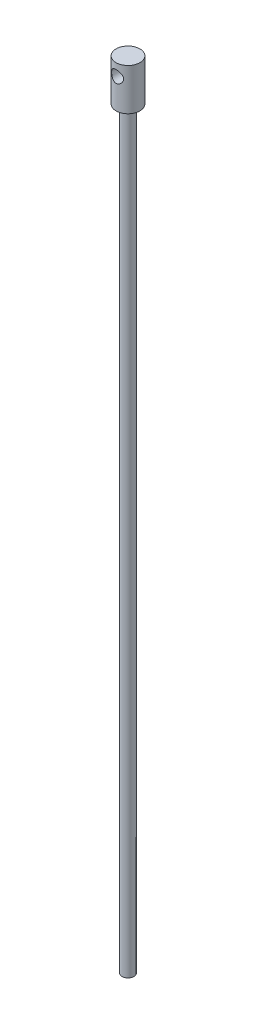
ISO-10303-21;
HEADER;
FILE_DESCRIPTION(('STEP AP214'),'2;1');
FILE_NAME('part.step','',(''),(''),'','','');
FILE_SCHEMA(('AUTOMOTIVE_DESIGN { 1 0 10303 214 1 1 1 1 }'));
ENDSEC;
DATA;
#1=APPLICATION_CONTEXT('core data for automotive mechanical design processes');
#2=APPLICATION_PROTOCOL_DEFINITION('international standard','automotive_design',2000,#1);
#3=PRODUCT_CONTEXT('',#1,'mechanical');
#4=PRODUCT('Part','Part','',(#3));
#5=PRODUCT_RELATED_PRODUCT_CATEGORY('part','',(#4));
#6=PRODUCT_DEFINITION_FORMATION('','',#4);
#7=PRODUCT_DEFINITION_CONTEXT('part definition',#1,'design');
#8=PRODUCT_DEFINITION('design','',#6,#7);
#9=PRODUCT_DEFINITION_SHAPE('','',#8);
#10=(LENGTH_UNIT() NAMED_UNIT(*) SI_UNIT(.MILLI.,.METRE.));
#11=(NAMED_UNIT(*) PLANE_ANGLE_UNIT() SI_UNIT($,.RADIAN.));
#12=(NAMED_UNIT(*) SI_UNIT($,.STERADIAN.) SOLID_ANGLE_UNIT());
#13=UNCERTAINTY_MEASURE_WITH_UNIT(LENGTH_MEASURE(1.E-05),#10,'distance_accuracy_value','');
#14=(GEOMETRIC_REPRESENTATION_CONTEXT(3) GLOBAL_UNCERTAINTY_ASSIGNED_CONTEXT((#13)) GLOBAL_UNIT_ASSIGNED_CONTEXT((#10,
#11,#12)) REPRESENTATION_CONTEXT('',''));
#15=CARTESIAN_POINT('',(0.,0.,0.));
#16=DIRECTION('',(0.,0.,1.));
#17=DIRECTION('',(1.,0.,0.));
#18=AXIS2_PLACEMENT_3D('',#15,#16,#17);
#19=CARTESIAN_POINT('',(0.,390.,0.));
#20=DIRECTION('',(0.,-1.,0.));
#21=DIRECTION('',(0.,0.,-1.));
#22=AXIS2_PLACEMENT_3D('',#19,#20,#21);
#23=CYLINDRICAL_SURFACE('',#22,3.);
#24=CARTESIAN_POINT('',(0.,0.,0.));
#25=DIRECTION('',(0.,1.,0.));
#26=DIRECTION('',(0.,0.,1.));
#27=AXIS2_PLACEMENT_3D('',#24,#25,#26);
#28=CIRCLE('',#27,3.);
#29=CARTESIAN_POINT('',(0.,0.,3.));
#30=VERTEX_POINT('',#29);
#31=EDGE_CURVE('E53',#30,#30,#28,.T.);
#32=ORIENTED_EDGE('',*,*,#31,.T.);
#33=EDGE_LOOP('',(#32));
#34=FACE_BOUND('',#33,.T.);
#35=CARTESIAN_POINT('',(0.,378.,0.));
#36=DIRECTION('',(0.,1.,0.));
#37=DIRECTION('',(0.,0.,1.));
#38=AXIS2_PLACEMENT_3D('',#35,#36,#37);
#39=CIRCLE('',#38,3.);
#40=CARTESIAN_POINT('',(0.,378.,3.));
#41=VERTEX_POINT('',#40);
#42=EDGE_CURVE('E10',#41,#41,#39,.T.);
#43=ORIENTED_EDGE('',*,*,#42,.F.);
#44=EDGE_LOOP('',(#43));
#45=FACE_BOUND('',#44,.T.);
#46=ADVANCED_FACE('F41',(#34,#45),#23,.T.);
#47=CARTESIAN_POINT('',(0.,0.,0.));
#48=DIRECTION('',(0.,1.,0.));
#49=DIRECTION('',(0.,0.,1.));
#50=AXIS2_PLACEMENT_3D('',#47,#48,#49);
#51=PLANE('',#50);
#52=ORIENTED_EDGE('',*,*,#31,.F.);
#53=EDGE_LOOP('',(#52));
#54=FACE_BOUND('',#53,.T.);
#55=ADVANCED_FACE('F84',(#54),#51,.F.);
#56=CARTESIAN_POINT('',(0.,378.,0.));
#57=DIRECTION('',(0.,1.,0.));
#58=DIRECTION('',(0.,0.,1.));
#59=AXIS2_PLACEMENT_3D('',#56,#57,#58);
#60=CYLINDRICAL_SURFACE('',#59,6.);
#61=CARTESIAN_POINT('',(0.,390.,6.));
#62=CARTESIAN_POINT('',(0.0788941476270884,390.000000838741,5.99999934964153));
#63=CARTESIAN_POINT('',(0.157796620407948,390.003117945476,5.99843869002385));
#64=CARTESIAN_POINT('',(0.315001991255919,390.01553927174,5.99224358793258));
#65=CARTESIAN_POINT('',(0.393304603620531,390.024846274065,5.98760776295702));
#66=CARTESIAN_POINT('',(0.626628691373735,390.061957856819,5.96921978027472));
#67=CARTESIAN_POINT('',(0.779952894844979,390.098952829063,5.95098734455496));
#68=CARTESIAN_POINT('',(1.07683586335996,390.195581774429,5.90448966743083));
#69=CARTESIAN_POINT('',(1.22043005484384,390.255127766208,5.87626344365679));
#70=CARTESIAN_POINT('',(1.49540820515374,390.394711250679,5.81237302716334));
#71=CARTESIAN_POINT('',(1.62679312559147,390.474747127703,5.77670942093695));
#72=CARTESIAN_POINT('',(1.88252701271777,390.658553980849,5.69868752298932));
#73=CARTESIAN_POINT('',(2.0059694541685,390.763467947521,5.65605474586613));
#74=CARTESIAN_POINT('',(2.23433451090185,390.991555921487,5.56980033629331));
#75=CARTESIAN_POINT('',(2.3392430135573,391.114743713165,5.5261779786051));
#76=CARTESIAN_POINT('',(2.53576864722248,391.387484360082,5.43896347969577));
#77=CARTESIAN_POINT('',(2.62572411176602,391.538340974458,5.39563602686729));
#78=CARTESIAN_POINT('',(2.74034031450292,391.775950854023,5.33782449719394));
#79=CARTESIAN_POINT('',(2.77516786882119,391.857070924563,5.31974570840245));
#80=CARTESIAN_POINT('',(2.83769299596486,392.02260057988,5.28665768365286));
#81=CARTESIAN_POINT('',(2.86539478083936,392.107008187258,5.27164663543394));
#82=CARTESIAN_POINT('',(2.91188280266506,392.273395796762,5.24610341708083));
#83=CARTESIAN_POINT('',(2.93110042292908,392.355222796757,5.23535838565201));
#84=CARTESIAN_POINT('',(2.96263559384682,392.52055490852,5.21757784151144));
#85=CARTESIAN_POINT('',(2.97495680535111,392.604059105541,5.21054036082125));
#86=CARTESIAN_POINT('',(2.99251382412706,392.772006367416,5.20047756645271));
#87=CARTESIAN_POINT('',(2.99775389857939,392.856448835894,5.19744983647105));
#88=CARTESIAN_POINT('',(3.00108452416055,393.025493654341,5.19552555967191));
#89=CARTESIAN_POINT('',(2.99917575741611,393.110095988288,5.19662861870362));
#90=CARTESIAN_POINT('',(2.98404973540405,393.342753898322,5.20534668059274));
#91=CARTESIAN_POINT('',(2.96335042632724,393.490244154154,5.21726794353738));
#92=CARTESIAN_POINT('',(2.90082280036695,393.779193676825,5.25228182412117));
#93=CARTESIAN_POINT('',(2.85898775295596,393.920651006951,5.27537800023379));
#94=CARTESIAN_POINT('',(2.75462843937305,394.197679650297,5.33062568888727));
#95=CARTESIAN_POINT('',(2.69164495870316,394.333037111751,5.36297559567996));
#96=CARTESIAN_POINT('',(2.547125305758,394.591904963314,5.43310175251306));
#97=CARTESIAN_POINT('',(2.46558080007524,394.71540999648,5.4708804371131));
#98=CARTESIAN_POINT('',(2.27419808739748,394.96356309378,5.55339485686876));
#99=CARTESIAN_POINT('',(2.16208335434888,395.086370442384,5.59840533924978));
#100=CARTESIAN_POINT('',(1.91866675699305,395.312206434202,5.68642866684949));
#101=CARTESIAN_POINT('',(1.78735577540361,395.415225624906,5.72944054996684));
#102=CARTESIAN_POINT('',(1.50154951155103,395.603056932019,5.81105962769461));
#103=CARTESIAN_POINT('',(1.34626077321061,395.686801403698,5.84936952731879));
#104=CARTESIAN_POINT('',(1.02139864805276,395.826291100758,5.91473643118065));
#105=CARTESIAN_POINT('',(0.85183672920368,395.88205855855,5.94180236767508));
#106=CARTESIAN_POINT('',(0.518299474608026,395.959426207936,5.97973001282228));
#107=CARTESIAN_POINT('',(0.35502459154511,395.983473706382,5.99174814919366));
#108=CARTESIAN_POINT('',(0.0263387999478747,396.004394194262,6.00219040361882));
#109=CARTESIAN_POINT('',(-0.139071059584265,396.00128005714,6.00062096160122));
#110=CARTESIAN_POINT('',(-0.453698915981436,395.96937993454,5.98473576763842));
#111=CARTESIAN_POINT('',(-0.603178224155132,395.942602401756,5.97141737064974));
#112=CARTESIAN_POINT('',(-0.895220676900461,395.867285784369,5.93466513944052));
#113=CARTESIAN_POINT('',(-1.03778305707533,395.818744300651,5.91123019004896));
#114=CARTESIAN_POINT('',(-1.31666582534656,395.700004600689,5.85552754239056));
#115=CARTESIAN_POINT('',(-1.45269119100304,395.629226849659,5.82302645301466));
#116=CARTESIAN_POINT('',(-1.71138408511219,395.468677393053,5.75231922959683));
#117=CARTESIAN_POINT('',(-1.83404588938514,395.378897596171,5.71411066728832));
#118=CARTESIAN_POINT('',(-2.07530306780483,395.172718724056,5.63124663977895));
#119=CARTESIAN_POINT('',(-2.19231623321555,395.054571394855,5.58632654410487));
#120=CARTESIAN_POINT('',(-2.40556896301297,394.800224546315,5.49787174706805));
#121=CARTESIAN_POINT('',(-2.5017941568685,394.66401264342,5.45433802170281));
#122=CARTESIAN_POINT('',(-2.67512374371699,394.36906903752,5.3715357665078));
#123=CARTESIAN_POINT('',(-2.75107648817019,394.209566202038,5.33257588763926));
#124=CARTESIAN_POINT('',(-2.87424847703563,393.877469796955,5.26722216885657));
#125=CARTESIAN_POINT('',(-2.92150474480837,393.704893419357,5.24081214709482));
#126=CARTESIAN_POINT('',(-2.9815850649252,393.369269332469,5.2068450303742));
#127=CARTESIAN_POINT('',(-2.997278998202,393.20689724371,5.19772150245586));
#128=CARTESIAN_POINT('',(-3.00206745414686,392.881658794493,5.19496064074354));
#129=CARTESIAN_POINT('',(-2.99117350647292,392.718792678857,5.20131659437267));
#130=CARTESIAN_POINT('',(-2.94577840699523,392.413549508907,5.22713585648299));
#131=CARTESIAN_POINT('',(-2.91362505078138,392.270698637734,5.24529281646866));
#132=CARTESIAN_POINT('',(-2.82952596688631,391.992575593543,5.29113050364645));
#133=CARTESIAN_POINT('',(-2.77757387249736,391.857305874472,5.31881429411659));
#134=CARTESIAN_POINT('',(-2.65144766382428,391.588125638335,5.38285583940632));
#135=CARTESIAN_POINT('',(-2.57601505988081,391.454917030521,5.41967139666624));
#136=CARTESIAN_POINT('',(-2.4064512676201,391.202175655064,5.49706022440067));
#137=CARTESIAN_POINT('',(-2.3123103512076,391.082650053596,5.5376354439705));
#138=CARTESIAN_POINT('',(-2.09461689129203,390.845577142512,5.62386853947506));
#139=CARTESIAN_POINT('',(-1.96888052183392,390.730034875839,5.66954494371952));
#140=CARTESIAN_POINT('',(-1.69843715077045,390.521198859929,5.75633712356326));
#141=CARTESIAN_POINT('',(-1.55371998850186,390.427917102978,5.79745043456127));
#142=CARTESIAN_POINT('',(-1.32452333533415,390.306821815443,5.85251406841985));
#143=CARTESIAN_POINT('',(-1.2457531477579,390.269479799758,5.86982524242743));
#144=CARTESIAN_POINT('',(-1.08479725492722,390.201638321176,5.90168845962536));
#145=CARTESIAN_POINT('',(-1.00261324805384,390.171135502967,5.91624185523758));
#146=CARTESIAN_POINT('',(-0.835616997915698,390.117392744007,5.94212690185115));
#147=CARTESIAN_POINT('',(-0.750810940130723,390.094136959236,5.95346557615479));
#148=CARTESIAN_POINT('',(-0.579142357408398,390.055117427219,5.97260771878739));
#149=CARTESIAN_POINT('',(-0.492281122825555,390.039349103444,5.98041334646939));
#150=CARTESIAN_POINT('',(-0.337824895315502,390.018315321387,5.99085829855372));
#151=CARTESIAN_POINT('',(-0.270495162095361,390.011453082274,5.99428035414515));
#152=CARTESIAN_POINT('',(-0.135445671381797,390.002294998557,5.99885151538357));
#153=CARTESIAN_POINT('',(-0.0677259031748707,389.999999279992,6.00000055829382));
#154=CARTESIAN_POINT('',(0.,390.,6.));
#155=B_SPLINE_CURVE_WITH_KNOTS('',3,(#61,#62,#63,#64,#65,#66,#67,#68,#69,#70,#71,#72,#73,#74,
#75,#76,#77,#78,#79,#80,#81,#82,#83,#84,#85,#86,#87,#88,#89,#90,#91,#92,#93,#94,#95,#96,#97,#98,
#99,#100,#101,#102,#103,#104,#105,#106,#107,#108,#109,#110,#111,#112,#113,#114,#115,#116,#117,
#118,#119,#120,#121,#122,#123,#124,#125,#126,#127,#128,#129,#130,#131,#132,#133,#134,#135,#136,
#137,#138,#139,#140,#141,#142,#143,#144,#145,#146,#147,#148,#149,#150,#151,#152,#153,#154),
.UNSPECIFIED.,.T.,.F.,(4,2,2,2,2,2,2,2,2,2,2,2,2,2,2,2,2,2,2,2,2,2,2,2,2,2,2,2,2,2,2,2,2,2,2,2,
2,2,2,2,2,2,2,2,2,2,4),(0.,0.236611432443571,0.473329310437703,0.947100987304406,
1.4190430046537,1.89094781992151,2.39140181433108,2.89223525113891,3.43190833109943,
3.7019271496784,3.97178599119157,4.22563720033317,4.47935352842592,4.73291689564232,
4.98645606901566,5.43238672147387,5.87845946700881,6.33492255429302,6.79159098704509,
7.30616358925475,7.82098138719902,8.35970601567164,8.89800185660683,9.3917140633788,
9.88519228458271,10.3404225444221,10.7957029981664,11.2640010300754,11.7324988716886,
12.2470036685628,12.7618630076938,13.3016558140826,13.8407507075944,14.3280945743222,
14.8152271451711,15.2559532566965,15.6968212128814,16.1673090526395,16.6380421835398,
17.1659726319344,17.6941868506379,17.9605054214138,18.2266930489271,18.4922945660822,
18.7577335310501,18.9608446764332,19.1639614277477),.UNSPECIFIED.);
#156=CARTESIAN_POINT('',(0.,390.,6.));
#157=VERTEX_POINT('',#156);
#158=EDGE_CURVE('E44',#157,#157,#155,.T.);
#159=ORIENTED_EDGE('',*,*,#158,.F.);
#160=EDGE_LOOP('',(#159));
#161=FACE_BOUND('',#160,.T.);
#162=CARTESIAN_POINT('',(3.,393.,-5.19615242270663));
#163=CARTESIAN_POINT('',(2.99999910875738,392.921799766741,-5.19615338151414));
#164=CARTESIAN_POINT('',(2.99693611207795,392.843590001535,-5.19792581191126));
#165=CARTESIAN_POINT('',(2.98473565374509,392.687791924858,-5.20493931657123));
#166=CARTESIAN_POINT('',(2.97559536411628,392.610203919732,-5.21018200566083));
#167=CARTESIAN_POINT('',(2.93916912258039,392.379055985754,-5.23088200558207));
#168=CARTESIAN_POINT('',(2.902878058149,392.227249089467,-5.25131076607215));
#169=CARTESIAN_POINT('',(2.80829998089523,391.933608366476,-5.3024774692754));
#170=CARTESIAN_POINT('',(2.75012989346617,391.791726198249,-5.33316051577918));
#171=CARTESIAN_POINT('',(2.61380253964662,391.519737238299,-5.40128072966972));
#172=CARTESIAN_POINT('',(2.53564419197538,391.389631084125,-5.43871826241347));
#173=CARTESIAN_POINT('',(2.35399963256537,391.133079853852,-5.51990583559838));
#174=CARTESIAN_POINT('',(2.24895611137363,391.007821797844,-5.56392184571631));
#175=CARTESIAN_POINT('',(2.01976141989961,390.77577563031,-5.651159547025));
#176=CARTESIAN_POINT('',(1.89560077655245,390.668996731743,-5.69438083245621));
#177=CARTESIAN_POINT('',(1.62146869109162,390.469898312268,-5.77864428988888));
#178=CARTESIAN_POINT('',(1.47032156718994,390.379038634073,-5.81934318752246));
#179=CARTESIAN_POINT('',(1.15247107964638,390.224577502572,-5.89052268800541));
#180=CARTESIAN_POINT('',(0.985777614653082,390.160958846753,-5.92100973690811));
#181=CARTESIAN_POINT('',(0.654134831556279,390.067486002011,-5.96641383603058));
#182=CARTESIAN_POINT('',(0.489905370480166,390.035551420352,-5.98228440595573));
#183=CARTESIAN_POINT('',(0.157711887079232,389.999501644556,-6.00022751605263));
#184=CARTESIAN_POINT('',(-0.0102498138110398,389.995369617868,-6.00230840492439));
#185=CARTESIAN_POINT('',(-0.329497576667926,390.014240032635,-5.9928894562274));
#186=CARTESIAN_POINT('',(-0.480963609704598,390.034914088078,-5.98255487247965));
#187=CARTESIAN_POINT('',(-0.77794130357985,390.098642490196,-5.9512273620779));
#188=CARTESIAN_POINT('',(-0.92345251797664,390.141698511578,-5.93023363786807));
#189=CARTESIAN_POINT('',(-1.20692822064063,390.24924785577,-5.87914748253371));
#190=CARTESIAN_POINT('',(-1.34476044303002,390.314029531201,-5.8489331854518));
#191=CARTESIAN_POINT('',(-1.60793023199368,390.462789656708,-5.78212944004645));
#192=CARTESIAN_POINT('',(-1.73326330217191,390.54677497951,-5.74553771044373));
#193=CARTESIAN_POINT('',(-1.98052168794676,390.74068847394,-5.66533158492102));
#194=CARTESIAN_POINT('',(-2.10100497271934,390.852318510642,-5.62138031742825));
#195=CARTESIAN_POINT('',(-2.32231036115799,391.093759741909,-5.53363118085844));
#196=CARTESIAN_POINT('',(-2.42311733790259,391.223584793896,-5.48983345502612));
#197=CARTESIAN_POINT('',(-2.60852695463449,391.507982143341,-5.40432084665525));
#198=CARTESIAN_POINT('',(-2.69169402852799,391.663602435646,-5.36291485750667));
#199=CARTESIAN_POINT('',(-2.79542837524198,391.907563054612,-5.30915194408667));
#200=CARTESIAN_POINT('',(-2.82650797342002,391.990656310405,-5.29261946495429));
#201=CARTESIAN_POINT('',(-2.88131297532035,392.159808603034,-5.26298473463269));
#202=CARTESIAN_POINT('',(-2.90504291399187,392.245865774475,-5.24988036897853));
#203=CARTESIAN_POINT('',(-2.94323927983805,392.413371620224,-5.22855455988392));
#204=CARTESIAN_POINT('',(-2.95828810706488,392.494649425638,-5.22002982263213));
#205=CARTESIAN_POINT('',(-2.98163903200843,392.658435238666,-5.2067273715729));
#206=CARTESIAN_POINT('',(-2.98994463830255,392.740942583748,-5.20194770920408));
#207=CARTESIAN_POINT('',(-2.99968663811345,392.906471006803,-5.19633662863607));
#208=CARTESIAN_POINT('',(-3.00112558946314,392.989491881944,-5.19550374026212));
#209=CARTESIAN_POINT('',(-2.99712742537403,393.155286460765,-5.19780953199967));
#210=CARTESIAN_POINT('',(-2.99169077406597,393.238060180751,-5.20094794403249));
#211=CARTESIAN_POINT('',(-2.96710135231213,393.466859136043,-5.21504493010247));
#212=CARTESIAN_POINT('',(-2.9405616310018,393.611910810263,-5.23019160660498));
#213=CARTESIAN_POINT('',(-2.86709067362228,393.895130910797,-5.27081666384498));
#214=CARTESIAN_POINT('',(-2.82015283383762,394.03329709183,-5.29629839028766));
#215=CARTESIAN_POINT('',(-2.7049422447844,394.30622610392,-5.35608780273034));
#216=CARTESIAN_POINT('',(-2.63578205088432,394.440534927904,-5.39074960412732));
#217=CARTESIAN_POINT('',(-2.47886133231335,394.696409938366,-5.46468327792417));
#218=CARTESIAN_POINT('',(-2.39109125263819,394.817969530812,-5.50395751387986));
#219=CARTESIAN_POINT('',(-2.18651145695799,395.060935626632,-5.58864005140301));
#220=CARTESIAN_POINT('',(-2.06743580499399,395.1803912709,-5.63419752084738));
#221=CARTESIAN_POINT('',(-1.81021349814979,395.398236895295,-5.72202702310923));
#222=CARTESIAN_POINT('',(-1.67206042712516,395.496619759676,-5.76429794308224));
#223=CARTESIAN_POINT('',(-1.37560608443381,395.671721127574,-5.84224085806641));
#224=CARTESIAN_POINT('',(-1.21686929217556,395.747799341883,-5.87770925226882));
#225=CARTESIAN_POINT('',(-0.886567094469546,395.871413724311,-5.93650064667294));
#226=CARTESIAN_POINT('',(-0.715013103124008,395.918974954842,-5.95983430919533));
#227=CARTESIAN_POINT('',(-0.380939047947197,395.980105691849,-5.9900252464518));
#228=CARTESIAN_POINT('',(-0.219034335650387,395.996393635561,-5.99819783930701));
#229=CARTESIAN_POINT('',(0.105377961951211,396.002529788434,-6.00126390919338));
#230=CARTESIAN_POINT('',(0.267885316317476,395.992387253183,-5.99616203476054));
#231=CARTESIAN_POINT('',(0.577613962536156,395.947750809867,-5.97401907190636));
#232=CARTESIAN_POINT('',(0.725136901247736,395.914905562334,-5.95778686442443));
#233=CARTESIAN_POINT('',(1.01233790874442,395.828018891968,-5.91576278551446));
#234=CARTESIAN_POINT('',(1.1520148492363,395.773974429458,-5.88996954319456));
#235=CARTESIAN_POINT('',(1.42627001605166,395.643819271311,-5.82977801711599));
#236=CARTESIAN_POINT('',(1.56037465678413,395.566863658464,-5.79505887623287));
#237=CARTESIAN_POINT('',(1.81432469711304,395.394124578586,-5.72064363382009));
#238=CARTESIAN_POINT('',(1.93416350676914,395.298332464011,-5.6809452494399));
#239=CARTESIAN_POINT('',(2.16873884087781,395.079615277516,-5.5958597881944));
#240=CARTESIAN_POINT('',(2.28178066887873,394.954938679226,-5.55029975504519));
#241=CARTESIAN_POINT('',(2.48600225783026,394.68762167193,-5.46188649509678));
#242=CARTESIAN_POINT('',(2.57716267726705,394.544965538969,-5.41903568750872));
#243=CARTESIAN_POINT('',(2.69665559342488,394.317468206698,-5.36004774906989));
#244=CARTESIAN_POINT('',(2.73405408762353,394.238024199018,-5.34101219148465));
#245=CARTESIAN_POINT('',(2.80191257626503,394.075646716991,-5.3057278306372));
#246=CARTESIAN_POINT('',(2.83237614466582,393.992715066252,-5.28947759301445));
#247=CARTESIAN_POINT('',(2.88592624586957,393.82415526763,-5.26045215868186));
#248=CARTESIAN_POINT('',(2.90903175649393,393.738534692759,-5.24766803509092));
#249=CARTESIAN_POINT('',(2.94762428051629,393.565144744686,-5.22608869625113));
#250=CARTESIAN_POINT('',(2.96311662049621,393.477376919079,-5.21729069243665));
#251=CARTESIAN_POINT('',(2.9830938122572,393.32460118224,-5.20588528016134));
#252=CARTESIAN_POINT('',(2.9894274622838,393.259905191093,-5.20224442588138));
#253=CARTESIAN_POINT('',(2.99788106792142,393.1301416832,-5.19737751744686));
#254=CARTESIAN_POINT('',(3.00000074164548,393.065074141892,-5.1961516248372));
#255=CARTESIAN_POINT('',(3.,393.,-5.19615242270663));
#256=B_SPLINE_CURVE_WITH_KNOTS('',3,(#162,#163,#164,#165,#166,#167,#168,#169,#170,#171,#172,
#173,#174,#175,#176,#177,#178,#179,#180,#181,#182,#183,#184,#185,#186,#187,#188,#189,#190,#191,
#192,#193,#194,#195,#196,#197,#198,#199,#200,#201,#202,#203,#204,#205,#206,#207,#208,#209,#210,
#211,#212,#213,#214,#215,#216,#217,#218,#219,#220,#221,#222,#223,#224,#225,#226,#227,#228,#229,
#230,#231,#232,#233,#234,#235,#236,#237,#238,#239,#240,#241,#242,#243,#244,#245,#246,#247,#248,
#249,#250,#251,#252,#253,#254,#255),.UNSPECIFIED.,.T.,.F.,(4,2,2,2,2,2,2,2,2,2,2,2,2,2,2,2,2,2,
2,2,2,2,2,2,2,2,2,2,2,2,2,2,2,2,2,2,2,2,2,2,2,2,2,2,2,2,4),(0.,0.234529430733928,
0.469168072604275,0.938850383294538,1.40605749261243,1.87328988121654,2.37905864237584,
2.88507883741224,3.42520847204403,3.96499651379786,4.46637625391918,4.96745241546232,
5.42495462941729,5.88249108040478,6.34635774681551,6.81039068538929,7.31828744858785,
7.82657315225868,8.36713695676453,8.63752916119815,8.90775419202331,9.156696007876,
9.40550821320576,9.6542277286079,9.90293045534216,10.3454331624118,10.788079232773,
11.2512265518737,11.7146122462925,12.2364099671094,12.7583836090371,13.29413310208,
13.8294110539542,14.3155757713756,14.8015702635102,15.2555404058358,15.7095756650514,
16.1830301812752,16.6567025627126,17.177514915193,17.6987859450456,17.9680115893229,
18.237098170763,18.5054849980178,18.7736837791728,18.9688338446806,19.1639969639895),.UNSPECIFIED.);
#257=CARTESIAN_POINT('',(3.,393.,-5.19615242270663));
#258=VERTEX_POINT('',#257);
#259=EDGE_CURVE('E61',#258,#258,#256,.T.);
#260=ORIENTED_EDGE('',*,*,#259,.F.);
#261=EDGE_LOOP('',(#260));
#262=FACE_BOUND('',#261,.T.);
#263=CARTESIAN_POINT('',(0.,378.,0.));
#264=DIRECTION('',(0.,1.,0.));
#265=DIRECTION('',(0.,0.,1.));
#266=AXIS2_PLACEMENT_3D('',#263,#264,#265);
#267=CIRCLE('',#266,6.);
#268=CARTESIAN_POINT('',(0.,378.,6.));
#269=VERTEX_POINT('',#268);
#270=EDGE_CURVE('E58',#269,#269,#267,.T.);
#271=ORIENTED_EDGE('',*,*,#270,.T.);
#272=EDGE_LOOP('',(#271));
#273=FACE_BOUND('',#272,.T.);
#274=CARTESIAN_POINT('',(0.,399.,0.));
#275=DIRECTION('',(0.,1.,0.));
#276=DIRECTION('',(0.,0.,1.));
#277=AXIS2_PLACEMENT_3D('',#274,#275,#276);
#278=CIRCLE('',#277,6.);
#279=CARTESIAN_POINT('',(0.,399.,6.));
#280=VERTEX_POINT('',#279);
#281=EDGE_CURVE('E132',#280,#280,#278,.T.);
#282=ORIENTED_EDGE('',*,*,#281,.F.);
#283=EDGE_LOOP('',(#282));
#284=FACE_BOUND('',#283,.T.);
#285=ADVANCED_FACE('F66',(#161,#262,#273,#284),#60,.T.);
#286=CARTESIAN_POINT('',(0.,378.,0.));
#287=DIRECTION('',(0.,1.,0.));
#288=DIRECTION('',(0.,0.,1.));
#289=AXIS2_PLACEMENT_3D('',#286,#287,#288);
#290=PLANE('',#289);
#291=ORIENTED_EDGE('',*,*,#42,.T.);
#292=EDGE_LOOP('',(#291));
#293=FACE_BOUND('',#292,.T.);
#294=ORIENTED_EDGE('',*,*,#270,.F.);
#295=EDGE_LOOP('',(#294));
#296=FACE_BOUND('',#295,.T.);
#297=ADVANCED_FACE('F77',(#293,#296),#290,.F.);
#298=CARTESIAN_POINT('',(0.,399.,0.));
#299=DIRECTION('',(0.,1.,0.));
#300=DIRECTION('',(0.,0.,1.));
#301=AXIS2_PLACEMENT_3D('',#298,#299,#300);
#302=PLANE('',#301);
#303=ORIENTED_EDGE('',*,*,#281,.T.);
#304=EDGE_LOOP('',(#303));
#305=FACE_BOUND('',#304,.T.);
#306=ADVANCED_FACE('F73',(#305),#302,.T.);
#307=CARTESIAN_POINT('',(0.,393.,-10.));
#308=DIRECTION('',(0.,0.,1.));
#309=DIRECTION('',(1.,0.,0.));
#310=AXIS2_PLACEMENT_3D('',#307,#308,#309);
#311=CYLINDRICAL_SURFACE('',#310,3.);
#312=ORIENTED_EDGE('',*,*,#158,.T.);
#313=EDGE_LOOP('',(#312));
#314=FACE_BOUND('',#313,.T.);
#315=ORIENTED_EDGE('',*,*,#259,.T.);
#316=EDGE_LOOP('',(#315));
#317=FACE_BOUND('',#316,.T.);
#318=ADVANCED_FACE('F69',(#314,#317),#311,.F.);
#319=CLOSED_SHELL('',(#46,#55,#285,#297,#306,#318));
#320=MANIFOLD_SOLID_BREP('B2',#319);
#321=ADVANCED_BREP_SHAPE_REPRESENTATION('',(#18,#320),#14);
#322=SHAPE_DEFINITION_REPRESENTATION(#9,#321);
ENDSEC;
END-ISO-10303-21;
